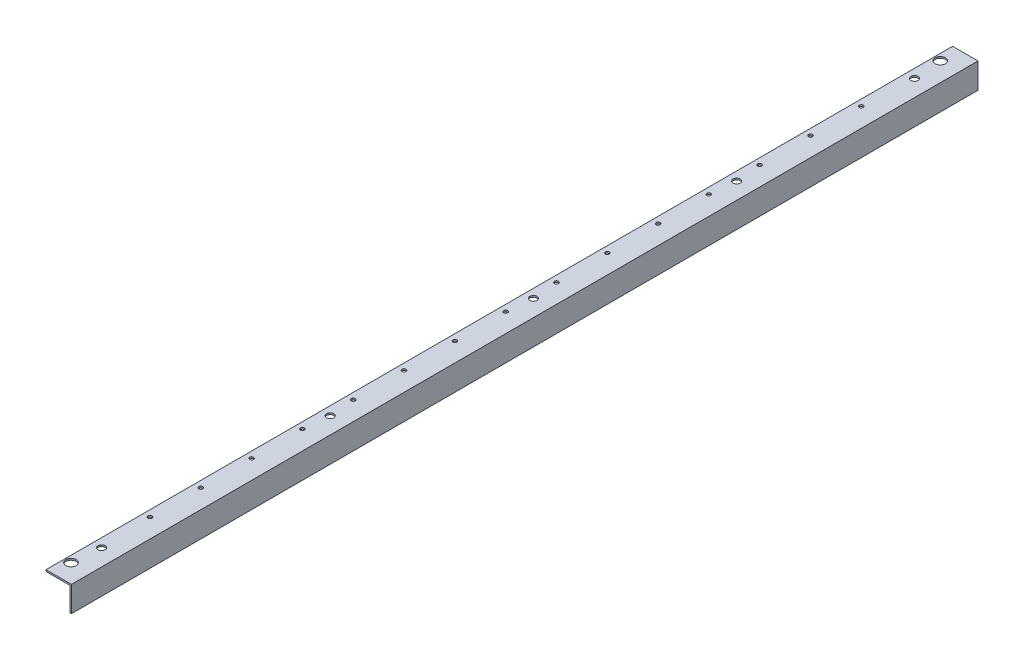
ISO-10303-21;
HEADER;
FILE_DESCRIPTION(('STEP AP214'),'2;1');
FILE_NAME('part.step','',(''),(''),'','','');
FILE_SCHEMA(('AUTOMOTIVE_DESIGN { 1 0 10303 214 1 1 1 1 }'));
ENDSEC;
DATA;
#1=APPLICATION_CONTEXT('core data for automotive mechanical design processes');
#2=APPLICATION_PROTOCOL_DEFINITION('international standard','automotive_design',2000,#1);
#3=PRODUCT_CONTEXT('',#1,'mechanical');
#4=PRODUCT('Part','Part','',(#3));
#5=PRODUCT_RELATED_PRODUCT_CATEGORY('part','',(#4));
#6=PRODUCT_DEFINITION_FORMATION('','',#4);
#7=PRODUCT_DEFINITION_CONTEXT('part definition',#1,'design');
#8=PRODUCT_DEFINITION('design','',#6,#7);
#9=PRODUCT_DEFINITION_SHAPE('','',#8);
#10=(LENGTH_UNIT() NAMED_UNIT(*) SI_UNIT(.MILLI.,.METRE.));
#11=(NAMED_UNIT(*) PLANE_ANGLE_UNIT() SI_UNIT($,.RADIAN.));
#12=(NAMED_UNIT(*) SI_UNIT($,.STERADIAN.) SOLID_ANGLE_UNIT());
#13=UNCERTAINTY_MEASURE_WITH_UNIT(LENGTH_MEASURE(1.E-05),#10,'distance_accuracy_value','');
#14=(GEOMETRIC_REPRESENTATION_CONTEXT(3) GLOBAL_UNCERTAINTY_ASSIGNED_CONTEXT((#13)) GLOBAL_UNIT_ASSIGNED_CONTEXT((#10,
#11,#12)) REPRESENTATION_CONTEXT('',''));
#15=CARTESIAN_POINT('',(0.,0.,0.));
#16=DIRECTION('',(0.,0.,1.));
#17=DIRECTION('',(1.,0.,0.));
#18=AXIS2_PLACEMENT_3D('',#15,#16,#17);
#19=CARTESIAN_POINT('',(-38.1,-44.45,1617.6625));
#20=DIRECTION('',(0.,1.,0.));
#21=DIRECTION('',(0.,0.,1.));
#22=AXIS2_PLACEMENT_3D('',#19,#20,#21);
#23=CYLINDRICAL_SURFACE('',#22,3.96874999999999);
#24=CARTESIAN_POINT('',(-38.1,0.,1617.6625));
#25=DIRECTION('',(0.,1.,0.));
#26=DIRECTION('',(0.,0.,1.));
#27=AXIS2_PLACEMENT_3D('',#24,#25,#26);
#28=CIRCLE('',#27,3.96874999999999);
#29=CARTESIAN_POINT('',(-38.1,0.,1621.63125));
#30=VERTEX_POINT('',#29);
#31=EDGE_CURVE('E42',#30,#30,#28,.T.);
#32=ORIENTED_EDGE('',*,*,#31,.T.);
#33=EDGE_LOOP('',(#32));
#34=FACE_BOUND('',#33,.T.);
#35=CARTESIAN_POINT('',(-38.1,-3.175,1617.6625));
#36=DIRECTION('',(0.,1.,0.));
#37=DIRECTION('',(0.,0.,1.));
#38=AXIS2_PLACEMENT_3D('',#35,#36,#37);
#39=CIRCLE('',#38,3.96874999999999);
#40=CARTESIAN_POINT('',(-38.1,-3.175,1621.63125));
#41=VERTEX_POINT('',#40);
#42=EDGE_CURVE('E11',#41,#41,#39,.T.);
#43=ORIENTED_EDGE('',*,*,#42,.F.);
#44=EDGE_LOOP('',(#43));
#45=FACE_BOUND('',#44,.T.);
#46=ADVANCED_FACE('F34',(#34,#45),#23,.F.);
#47=CARTESIAN_POINT('',(-38.1,-44.45,1516.0625));
#48=DIRECTION('',(0.,1.,0.));
#49=DIRECTION('',(0.,0.,1.));
#50=AXIS2_PLACEMENT_3D('',#47,#48,#49);
#51=CYLINDRICAL_SURFACE('',#50,3.96874999999999);
#52=CARTESIAN_POINT('',(-38.1,0.,1516.0625));
#53=DIRECTION('',(0.,1.,0.));
#54=DIRECTION('',(0.,0.,1.));
#55=AXIS2_PLACEMENT_3D('',#52,#53,#54);
#56=CIRCLE('',#55,3.96874999999999);
#57=CARTESIAN_POINT('',(-38.1,0.,1520.03125));
#58=VERTEX_POINT('',#57);
#59=EDGE_CURVE('E232',#58,#58,#56,.T.);
#60=ORIENTED_EDGE('',*,*,#59,.T.);
#61=EDGE_LOOP('',(#60));
#62=FACE_BOUND('',#61,.T.);
#63=CARTESIAN_POINT('',(-38.1,-3.175,1516.0625));
#64=DIRECTION('',(0.,1.,0.));
#65=DIRECTION('',(0.,0.,1.));
#66=AXIS2_PLACEMENT_3D('',#63,#64,#65);
#67=CIRCLE('',#66,3.96874999999999);
#68=CARTESIAN_POINT('',(-38.1,-3.175,1520.03125));
#69=VERTEX_POINT('',#68);
#70=EDGE_CURVE('E235',#69,#69,#67,.T.);
#71=ORIENTED_EDGE('',*,*,#70,.F.);
#72=EDGE_LOOP('',(#71));
#73=FACE_BOUND('',#72,.T.);
#74=ADVANCED_FACE('F260',(#62,#73),#51,.F.);
#75=CARTESIAN_POINT('',(-38.1,-44.45,1414.4625));
#76=DIRECTION('',(0.,1.,0.));
#77=DIRECTION('',(0.,0.,1.));
#78=AXIS2_PLACEMENT_3D('',#75,#76,#77);
#79=CYLINDRICAL_SURFACE('',#78,3.96874999999999);
#80=CARTESIAN_POINT('',(-38.1,0.,1414.4625));
#81=DIRECTION('',(0.,1.,0.));
#82=DIRECTION('',(0.,0.,1.));
#83=AXIS2_PLACEMENT_3D('',#80,#81,#82);
#84=CIRCLE('',#83,3.96874999999999);
#85=CARTESIAN_POINT('',(-38.1,0.,1418.43125));
#86=VERTEX_POINT('',#85);
#87=EDGE_CURVE('E226',#86,#86,#84,.T.);
#88=ORIENTED_EDGE('',*,*,#87,.T.);
#89=EDGE_LOOP('',(#88));
#90=FACE_BOUND('',#89,.T.);
#91=CARTESIAN_POINT('',(-38.1,-3.175,1414.4625));
#92=DIRECTION('',(0.,1.,0.));
#93=DIRECTION('',(0.,0.,1.));
#94=AXIS2_PLACEMENT_3D('',#91,#92,#93);
#95=CIRCLE('',#94,3.96874999999999);
#96=CARTESIAN_POINT('',(-38.1,-3.175,1418.43125));
#97=VERTEX_POINT('',#96);
#98=EDGE_CURVE('E229',#97,#97,#95,.T.);
#99=ORIENTED_EDGE('',*,*,#98,.F.);
#100=EDGE_LOOP('',(#99));
#101=FACE_BOUND('',#100,.T.);
#102=ADVANCED_FACE('F264',(#90,#101),#79,.F.);
#103=CARTESIAN_POINT('',(-38.1,-44.45,1312.8625));
#104=DIRECTION('',(0.,1.,0.));
#105=DIRECTION('',(0.,0.,1.));
#106=AXIS2_PLACEMENT_3D('',#103,#104,#105);
#107=CYLINDRICAL_SURFACE('',#106,3.96874999999999);
#108=CARTESIAN_POINT('',(-38.1,0.,1312.8625));
#109=DIRECTION('',(0.,1.,0.));
#110=DIRECTION('',(0.,0.,1.));
#111=AXIS2_PLACEMENT_3D('',#108,#109,#110);
#112=CIRCLE('',#111,3.96874999999999);
#113=CARTESIAN_POINT('',(-38.1,0.,1316.83125));
#114=VERTEX_POINT('',#113);
#115=EDGE_CURVE('E220',#114,#114,#112,.T.);
#116=ORIENTED_EDGE('',*,*,#115,.T.);
#117=EDGE_LOOP('',(#116));
#118=FACE_BOUND('',#117,.T.);
#119=CARTESIAN_POINT('',(-38.1,-3.175,1312.8625));
#120=DIRECTION('',(0.,1.,0.));
#121=DIRECTION('',(0.,0.,1.));
#122=AXIS2_PLACEMENT_3D('',#119,#120,#121);
#123=CIRCLE('',#122,3.96874999999999);
#124=CARTESIAN_POINT('',(-38.1,-3.175,1316.83125));
#125=VERTEX_POINT('',#124);
#126=EDGE_CURVE('E223',#125,#125,#123,.T.);
#127=ORIENTED_EDGE('',*,*,#126,.F.);
#128=EDGE_LOOP('',(#127));
#129=FACE_BOUND('',#128,.T.);
#130=ADVANCED_FACE('F269',(#118,#129),#107,.F.);
#131=CARTESIAN_POINT('',(-38.1,-44.45,1211.2625));
#132=DIRECTION('',(0.,1.,0.));
#133=DIRECTION('',(0.,0.,1.));
#134=AXIS2_PLACEMENT_3D('',#131,#132,#133);
#135=CYLINDRICAL_SURFACE('',#134,3.96874999999999);
#136=CARTESIAN_POINT('',(-38.1,0.,1211.2625));
#137=DIRECTION('',(0.,1.,0.));
#138=DIRECTION('',(0.,0.,1.));
#139=AXIS2_PLACEMENT_3D('',#136,#137,#138);
#140=CIRCLE('',#139,3.96874999999999);
#141=CARTESIAN_POINT('',(-38.1,0.,1215.23125));
#142=VERTEX_POINT('',#141);
#143=EDGE_CURVE('E214',#142,#142,#140,.T.);
#144=ORIENTED_EDGE('',*,*,#143,.T.);
#145=EDGE_LOOP('',(#144));
#146=FACE_BOUND('',#145,.T.);
#147=CARTESIAN_POINT('',(-38.1,-3.175,1211.2625));
#148=DIRECTION('',(0.,1.,0.));
#149=DIRECTION('',(0.,0.,1.));
#150=AXIS2_PLACEMENT_3D('',#147,#148,#149);
#151=CIRCLE('',#150,3.96874999999999);
#152=CARTESIAN_POINT('',(-38.1,-3.175,1215.23125));
#153=VERTEX_POINT('',#152);
#154=EDGE_CURVE('E217',#153,#153,#151,.T.);
#155=ORIENTED_EDGE('',*,*,#154,.F.);
#156=EDGE_LOOP('',(#155));
#157=FACE_BOUND('',#156,.T.);
#158=ADVANCED_FACE('F276',(#146,#157),#135,.F.);
#159=CARTESIAN_POINT('',(-38.1,-44.45,1109.6625));
#160=DIRECTION('',(0.,1.,0.));
#161=DIRECTION('',(0.,0.,1.));
#162=AXIS2_PLACEMENT_3D('',#159,#160,#161);
#163=CYLINDRICAL_SURFACE('',#162,3.96874999999999);
#164=CARTESIAN_POINT('',(-38.1,0.,1109.6625));
#165=DIRECTION('',(0.,1.,0.));
#166=DIRECTION('',(0.,0.,1.));
#167=AXIS2_PLACEMENT_3D('',#164,#165,#166);
#168=CIRCLE('',#167,3.96874999999999);
#169=CARTESIAN_POINT('',(-38.1,0.,1113.63125));
#170=VERTEX_POINT('',#169);
#171=EDGE_CURVE('E208',#170,#170,#168,.T.);
#172=ORIENTED_EDGE('',*,*,#171,.T.);
#173=EDGE_LOOP('',(#172));
#174=FACE_BOUND('',#173,.T.);
#175=CARTESIAN_POINT('',(-38.1,-3.175,1109.6625));
#176=DIRECTION('',(0.,1.,0.));
#177=DIRECTION('',(0.,0.,1.));
#178=AXIS2_PLACEMENT_3D('',#175,#176,#177);
#179=CIRCLE('',#178,3.96874999999999);
#180=CARTESIAN_POINT('',(-38.1,-3.175,1113.63125));
#181=VERTEX_POINT('',#180);
#182=EDGE_CURVE('E211',#181,#181,#179,.T.);
#183=ORIENTED_EDGE('',*,*,#182,.F.);
#184=EDGE_LOOP('',(#183));
#185=FACE_BOUND('',#184,.T.);
#186=ADVANCED_FACE('F280',(#174,#185),#163,.F.);
#187=CARTESIAN_POINT('',(-38.1,-44.45,1008.0625));
#188=DIRECTION('',(0.,1.,0.));
#189=DIRECTION('',(0.,0.,1.));
#190=AXIS2_PLACEMENT_3D('',#187,#188,#189);
#191=CYLINDRICAL_SURFACE('',#190,3.96874999999999);
#192=CARTESIAN_POINT('',(-38.1,0.,1008.0625));
#193=DIRECTION('',(0.,1.,0.));
#194=DIRECTION('',(0.,0.,1.));
#195=AXIS2_PLACEMENT_3D('',#192,#193,#194);
#196=CIRCLE('',#195,3.96874999999999);
#197=CARTESIAN_POINT('',(-38.1,0.,1012.03125));
#198=VERTEX_POINT('',#197);
#199=EDGE_CURVE('E202',#198,#198,#196,.T.);
#200=ORIENTED_EDGE('',*,*,#199,.T.);
#201=EDGE_LOOP('',(#200));
#202=FACE_BOUND('',#201,.T.);
#203=CARTESIAN_POINT('',(-38.1,-3.175,1008.0625));
#204=DIRECTION('',(0.,1.,0.));
#205=DIRECTION('',(0.,0.,1.));
#206=AXIS2_PLACEMENT_3D('',#203,#204,#205);
#207=CIRCLE('',#206,3.96874999999999);
#208=CARTESIAN_POINT('',(-38.1,-3.175,1012.03125));
#209=VERTEX_POINT('',#208);
#210=EDGE_CURVE('E205',#209,#209,#207,.T.);
#211=ORIENTED_EDGE('',*,*,#210,.F.);
#212=EDGE_LOOP('',(#211));
#213=FACE_BOUND('',#212,.T.);
#214=ADVANCED_FACE('F284',(#202,#213),#191,.F.);
#215=CARTESIAN_POINT('',(-38.1,-44.45,906.4625));
#216=DIRECTION('',(0.,1.,0.));
#217=DIRECTION('',(0.,0.,1.));
#218=AXIS2_PLACEMENT_3D('',#215,#216,#217);
#219=CYLINDRICAL_SURFACE('',#218,3.96874999999999);
#220=CARTESIAN_POINT('',(-38.1,0.,906.4625));
#221=DIRECTION('',(0.,1.,0.));
#222=DIRECTION('',(0.,0.,1.));
#223=AXIS2_PLACEMENT_3D('',#220,#221,#222);
#224=CIRCLE('',#223,3.96874999999999);
#225=CARTESIAN_POINT('',(-38.1,0.,910.43125));
#226=VERTEX_POINT('',#225);
#227=EDGE_CURVE('E196',#226,#226,#224,.T.);
#228=ORIENTED_EDGE('',*,*,#227,.T.);
#229=EDGE_LOOP('',(#228));
#230=FACE_BOUND('',#229,.T.);
#231=CARTESIAN_POINT('',(-38.1,-3.175,906.4625));
#232=DIRECTION('',(0.,1.,0.));
#233=DIRECTION('',(0.,0.,1.));
#234=AXIS2_PLACEMENT_3D('',#231,#232,#233);
#235=CIRCLE('',#234,3.96874999999999);
#236=CARTESIAN_POINT('',(-38.1,-3.175,910.43125));
#237=VERTEX_POINT('',#236);
#238=EDGE_CURVE('E199',#237,#237,#235,.T.);
#239=ORIENTED_EDGE('',*,*,#238,.F.);
#240=EDGE_LOOP('',(#239));
#241=FACE_BOUND('',#240,.T.);
#242=ADVANCED_FACE('F288',(#230,#241),#219,.F.);
#243=CARTESIAN_POINT('',(-38.1,-44.45,804.8625));
#244=DIRECTION('',(0.,1.,0.));
#245=DIRECTION('',(0.,0.,1.));
#246=AXIS2_PLACEMENT_3D('',#243,#244,#245);
#247=CYLINDRICAL_SURFACE('',#246,3.96874999999999);
#248=CARTESIAN_POINT('',(-38.1,0.,804.8625));
#249=DIRECTION('',(0.,1.,0.));
#250=DIRECTION('',(0.,0.,1.));
#251=AXIS2_PLACEMENT_3D('',#248,#249,#250);
#252=CIRCLE('',#251,3.96874999999999);
#253=CARTESIAN_POINT('',(-38.1,0.,808.83125));
#254=VERTEX_POINT('',#253);
#255=EDGE_CURVE('E190',#254,#254,#252,.T.);
#256=ORIENTED_EDGE('',*,*,#255,.T.);
#257=EDGE_LOOP('',(#256));
#258=FACE_BOUND('',#257,.T.);
#259=CARTESIAN_POINT('',(-38.1,-3.175,804.8625));
#260=DIRECTION('',(0.,1.,0.));
#261=DIRECTION('',(0.,0.,1.));
#262=AXIS2_PLACEMENT_3D('',#259,#260,#261);
#263=CIRCLE('',#262,3.96874999999999);
#264=CARTESIAN_POINT('',(-38.1,-3.175,808.83125));
#265=VERTEX_POINT('',#264);
#266=EDGE_CURVE('E193',#265,#265,#263,.T.);
#267=ORIENTED_EDGE('',*,*,#266,.F.);
#268=EDGE_LOOP('',(#267));
#269=FACE_BOUND('',#268,.T.);
#270=ADVANCED_FACE('F292',(#258,#269),#247,.F.);
#271=CARTESIAN_POINT('',(-38.1,-44.45,703.2625));
#272=DIRECTION('',(0.,1.,0.));
#273=DIRECTION('',(0.,0.,1.));
#274=AXIS2_PLACEMENT_3D('',#271,#272,#273);
#275=CYLINDRICAL_SURFACE('',#274,3.96874999999999);
#276=CARTESIAN_POINT('',(-38.1,0.,703.2625));
#277=DIRECTION('',(0.,1.,0.));
#278=DIRECTION('',(0.,0.,1.));
#279=AXIS2_PLACEMENT_3D('',#276,#277,#278);
#280=CIRCLE('',#279,3.96874999999999);
#281=CARTESIAN_POINT('',(-38.1,0.,707.23125));
#282=VERTEX_POINT('',#281);
#283=EDGE_CURVE('E184',#282,#282,#280,.T.);
#284=ORIENTED_EDGE('',*,*,#283,.T.);
#285=EDGE_LOOP('',(#284));
#286=FACE_BOUND('',#285,.T.);
#287=CARTESIAN_POINT('',(-38.1,-3.175,703.2625));
#288=DIRECTION('',(0.,1.,0.));
#289=DIRECTION('',(0.,0.,1.));
#290=AXIS2_PLACEMENT_3D('',#287,#288,#289);
#291=CIRCLE('',#290,3.96874999999999);
#292=CARTESIAN_POINT('',(-38.1,-3.175,707.23125));
#293=VERTEX_POINT('',#292);
#294=EDGE_CURVE('E187',#293,#293,#291,.T.);
#295=ORIENTED_EDGE('',*,*,#294,.F.);
#296=EDGE_LOOP('',(#295));
#297=FACE_BOUND('',#296,.T.);
#298=ADVANCED_FACE('F296',(#286,#297),#275,.F.);
#299=CARTESIAN_POINT('',(-38.1,-44.45,601.6625));
#300=DIRECTION('',(0.,1.,0.));
#301=DIRECTION('',(0.,0.,1.));
#302=AXIS2_PLACEMENT_3D('',#299,#300,#301);
#303=CYLINDRICAL_SURFACE('',#302,3.96874999999999);
#304=CARTESIAN_POINT('',(-38.1,0.,601.6625));
#305=DIRECTION('',(0.,1.,0.));
#306=DIRECTION('',(0.,0.,1.));
#307=AXIS2_PLACEMENT_3D('',#304,#305,#306);
#308=CIRCLE('',#307,3.96874999999999);
#309=CARTESIAN_POINT('',(-38.1,0.,605.63125));
#310=VERTEX_POINT('',#309);
#311=EDGE_CURVE('E178',#310,#310,#308,.T.);
#312=ORIENTED_EDGE('',*,*,#311,.T.);
#313=EDGE_LOOP('',(#312));
#314=FACE_BOUND('',#313,.T.);
#315=CARTESIAN_POINT('',(-38.1,-3.175,601.6625));
#316=DIRECTION('',(0.,1.,0.));
#317=DIRECTION('',(0.,0.,1.));
#318=AXIS2_PLACEMENT_3D('',#315,#316,#317);
#319=CIRCLE('',#318,3.96874999999999);
#320=CARTESIAN_POINT('',(-38.1,-3.175,605.63125));
#321=VERTEX_POINT('',#320);
#322=EDGE_CURVE('E181',#321,#321,#319,.T.);
#323=ORIENTED_EDGE('',*,*,#322,.F.);
#324=EDGE_LOOP('',(#323));
#325=FACE_BOUND('',#324,.T.);
#326=ADVANCED_FACE('F300',(#314,#325),#303,.F.);
#327=CARTESIAN_POINT('',(-38.1,-44.45,500.0625));
#328=DIRECTION('',(0.,1.,0.));
#329=DIRECTION('',(0.,0.,1.));
#330=AXIS2_PLACEMENT_3D('',#327,#328,#329);
#331=CYLINDRICAL_SURFACE('',#330,3.96874999999999);
#332=CARTESIAN_POINT('',(-38.1,0.,500.0625));
#333=DIRECTION('',(0.,1.,0.));
#334=DIRECTION('',(0.,0.,1.));
#335=AXIS2_PLACEMENT_3D('',#332,#333,#334);
#336=CIRCLE('',#335,3.96874999999999);
#337=CARTESIAN_POINT('',(-38.1,0.,504.03125));
#338=VERTEX_POINT('',#337);
#339=EDGE_CURVE('E172',#338,#338,#336,.T.);
#340=ORIENTED_EDGE('',*,*,#339,.T.);
#341=EDGE_LOOP('',(#340));
#342=FACE_BOUND('',#341,.T.);
#343=CARTESIAN_POINT('',(-38.1,-3.175,500.0625));
#344=DIRECTION('',(0.,1.,0.));
#345=DIRECTION('',(0.,0.,1.));
#346=AXIS2_PLACEMENT_3D('',#343,#344,#345);
#347=CIRCLE('',#346,3.96874999999999);
#348=CARTESIAN_POINT('',(-38.1,-3.175,504.03125));
#349=VERTEX_POINT('',#348);
#350=EDGE_CURVE('E175',#349,#349,#347,.T.);
#351=ORIENTED_EDGE('',*,*,#350,.F.);
#352=EDGE_LOOP('',(#351));
#353=FACE_BOUND('',#352,.T.);
#354=ADVANCED_FACE('F304',(#342,#353),#331,.F.);
#355=CARTESIAN_POINT('',(-38.1,-44.45,398.4625));
#356=DIRECTION('',(0.,1.,0.));
#357=DIRECTION('',(0.,0.,1.));
#358=AXIS2_PLACEMENT_3D('',#355,#356,#357);
#359=CYLINDRICAL_SURFACE('',#358,3.96874999999999);
#360=CARTESIAN_POINT('',(-38.1,0.,398.4625));
#361=DIRECTION('',(0.,1.,0.));
#362=DIRECTION('',(0.,0.,1.));
#363=AXIS2_PLACEMENT_3D('',#360,#361,#362);
#364=CIRCLE('',#363,3.96874999999999);
#365=CARTESIAN_POINT('',(-38.1,0.,402.43125));
#366=VERTEX_POINT('',#365);
#367=EDGE_CURVE('E140',#366,#366,#364,.T.);
#368=ORIENTED_EDGE('',*,*,#367,.T.);
#369=EDGE_LOOP('',(#368));
#370=FACE_BOUND('',#369,.T.);
#371=CARTESIAN_POINT('',(-38.1,-3.175,398.4625));
#372=DIRECTION('',(0.,1.,0.));
#373=DIRECTION('',(0.,0.,1.));
#374=AXIS2_PLACEMENT_3D('',#371,#372,#373);
#375=CIRCLE('',#374,3.96874999999999);
#376=CARTESIAN_POINT('',(-38.1,-3.175,402.43125));
#377=VERTEX_POINT('',#376);
#378=EDGE_CURVE('E169',#377,#377,#375,.T.);
#379=ORIENTED_EDGE('',*,*,#378,.F.);
#380=EDGE_LOOP('',(#379));
#381=FACE_BOUND('',#380,.T.);
#382=ADVANCED_FACE('F254',(#370,#381),#359,.F.);
#383=CARTESIAN_POINT('',(0.,-50.8,1812.925));
#384=DIRECTION('',(-1.,0.,0.));
#385=DIRECTION('',(0.,0.,1.));
#386=AXIS2_PLACEMENT_3D('',#383,#384,#385);
#387=PLANE('',#386);
#388=DIRECTION('',(0.,1.,0.));
#389=VECTOR('',#388,1.);
#390=CARTESIAN_POINT('',(0.,-50.8,0.));
#391=LINE('',#390,#389);
#392=CARTESIAN_POINT('',(0.,-50.8,0.));
#393=VERTEX_POINT('',#392);
#394=CARTESIAN_POINT('',(0.,0.,0.));
#395=VERTEX_POINT('',#394);
#396=EDGE_CURVE('E120',#393,#395,#391,.T.);
#397=ORIENTED_EDGE('',*,*,#396,.T.);
#398=DIRECTION('',(0.,0.,-1.));
#399=VECTOR('',#398,1.);
#400=CARTESIAN_POINT('',(0.,0.,1812.925));
#401=LINE('',#400,#399);
#402=CARTESIAN_POINT('',(0.,0.,1812.925));
#403=VERTEX_POINT('',#402);
#404=EDGE_CURVE('E138',#403,#395,#401,.T.);
#405=ORIENTED_EDGE('',*,*,#404,.F.);
#406=DIRECTION('',(0.,1.,0.));
#407=VECTOR('',#406,1.);
#408=CARTESIAN_POINT('',(0.,-50.8,1812.925));
#409=LINE('',#408,#407);
#410=CARTESIAN_POINT('',(0.,-50.8,1812.925));
#411=VERTEX_POINT('',#410);
#412=EDGE_CURVE('E131',#411,#403,#409,.T.);
#413=ORIENTED_EDGE('',*,*,#412,.F.);
#414=DIRECTION('',(0.,0.,-1.));
#415=VECTOR('',#414,1.);
#416=CARTESIAN_POINT('',(0.,-50.8,1812.925));
#417=LINE('',#416,#415);
#418=EDGE_CURVE('E116',#411,#393,#417,.T.);
#419=ORIENTED_EDGE('',*,*,#418,.T.);
#420=EDGE_LOOP('',(#397,#405,#413,#419));
#421=FACE_BOUND('',#420,.T.);
#422=ADVANCED_FACE('F245',(#421),#387,.F.);
#423=CARTESIAN_POINT('',(0.,0.,1812.925));
#424=DIRECTION('',(0.,-1.,0.));
#425=DIRECTION('',(0.,0.,-1.));
#426=AXIS2_PLACEMENT_3D('',#423,#424,#425);
#427=PLANE('',#426);
#428=CARTESIAN_POINT('',(-38.1,0.,296.8625));
#429=DIRECTION('',(0.,1.,0.));
#430=DIRECTION('',(0.,0.,1.));
#431=AXIS2_PLACEMENT_3D('',#428,#429,#430);
#432=CIRCLE('',#431,3.96874999999999);
#433=CARTESIAN_POINT('',(-38.1,0.,300.83125));
#434=VERTEX_POINT('',#433);
#435=EDGE_CURVE('E408',#434,#434,#432,.T.);
#436=ORIENTED_EDGE('',*,*,#435,.F.);
#437=EDGE_LOOP('',(#436));
#438=FACE_BOUND('',#437,.T.);
#439=CARTESIAN_POINT('',(-38.1,0.,195.2625));
#440=DIRECTION('',(0.,1.,0.));
#441=DIRECTION('',(0.,0.,1.));
#442=AXIS2_PLACEMENT_3D('',#439,#440,#441);
#443=CIRCLE('',#442,3.96874999999999);
#444=CARTESIAN_POINT('',(-38.1,0.,199.23125));
#445=VERTEX_POINT('',#444);
#446=EDGE_CURVE('E166',#445,#445,#443,.T.);
#447=ORIENTED_EDGE('',*,*,#446,.F.);
#448=EDGE_LOOP('',(#447));
#449=FACE_BOUND('',#448,.T.);
#450=CARTESIAN_POINT('',(-38.1,0.,37.3062500000001));
#451=DIRECTION('',(0.,1.,0.));
#452=DIRECTION('',(0.,0.,1.));
#453=AXIS2_PLACEMENT_3D('',#450,#451,#452);
#454=CIRCLE('',#453,10.31875);
#455=CARTESIAN_POINT('',(-38.1,0.,47.6250000000001));
#456=VERTEX_POINT('',#455);
#457=EDGE_CURVE('E145',#456,#456,#454,.T.);
#458=ORIENTED_EDGE('',*,*,#457,.F.);
#459=EDGE_LOOP('',(#458));
#460=FACE_BOUND('',#459,.T.);
#461=CARTESIAN_POINT('',(-33.3375,0.,1719.2625));
#462=DIRECTION('',(0.,1.,0.));
#463=DIRECTION('',(0.,0.,1.));
#464=AXIS2_PLACEMENT_3D('',#461,#462,#463);
#465=CIRCLE('',#464,7.14375000000008);
#466=CARTESIAN_POINT('',(-33.3375,0.,1726.40625));
#467=VERTEX_POINT('',#466);
#468=EDGE_CURVE('E165',#467,#467,#465,.T.);
#469=ORIENTED_EDGE('',*,*,#468,.F.);
#470=EDGE_LOOP('',(#469));
#471=FACE_BOUND('',#470,.T.);
#472=CARTESIAN_POINT('',(-33.3375,0.,1262.0625));
#473=DIRECTION('',(0.,1.,0.));
#474=DIRECTION('',(0.,0.,1.));
#475=AXIS2_PLACEMENT_3D('',#472,#473,#474);
#476=CIRCLE('',#475,7.14375);
#477=CARTESIAN_POINT('',(-33.3375,0.,1269.20625));
#478=VERTEX_POINT('',#477);
#479=EDGE_CURVE('E419',#478,#478,#476,.T.);
#480=ORIENTED_EDGE('',*,*,#479,.F.);
#481=EDGE_LOOP('',(#480));
#482=FACE_BOUND('',#481,.T.);
#483=CARTESIAN_POINT('',(-38.0999999999999,0.,1775.61875));
#484=DIRECTION('',(0.,1.,0.));
#485=DIRECTION('',(0.,0.,1.));
#486=AXIS2_PLACEMENT_3D('',#483,#484,#485);
#487=CIRCLE('',#486,10.31875);
#488=CARTESIAN_POINT('',(-38.0999999999999,0.,1785.9375));
#489=VERTEX_POINT('',#488);
#490=EDGE_CURVE('E418',#489,#489,#487,.T.);
#491=ORIENTED_EDGE('',*,*,#490,.F.);
#492=EDGE_LOOP('',(#491));
#493=FACE_BOUND('',#492,.T.);
#494=CARTESIAN_POINT('',(-33.3375,0.,93.6625));
#495=DIRECTION('',(0.,1.,0.));
#496=DIRECTION('',(0.,0.,1.));
#497=AXIS2_PLACEMENT_3D('',#494,#495,#496);
#498=CIRCLE('',#497,7.14375);
#499=CARTESIAN_POINT('',(-33.3375,0.,100.80625));
#500=VERTEX_POINT('',#499);
#501=EDGE_CURVE('E428',#500,#500,#498,.T.);
#502=ORIENTED_EDGE('',*,*,#501,.F.);
#503=EDGE_LOOP('',(#502));
#504=FACE_BOUND('',#503,.T.);
#505=CARTESIAN_POINT('',(-33.3375,0.,449.2625));
#506=DIRECTION('',(0.,1.,0.));
#507=DIRECTION('',(0.,0.,1.));
#508=AXIS2_PLACEMENT_3D('',#505,#506,#507);
#509=CIRCLE('',#508,7.14375000000002);
#510=CARTESIAN_POINT('',(-33.3375,0.,456.40625));
#511=VERTEX_POINT('',#510);
#512=EDGE_CURVE('E425',#511,#511,#509,.T.);
#513=ORIENTED_EDGE('',*,*,#512,.F.);
#514=EDGE_LOOP('',(#513));
#515=FACE_BOUND('',#514,.T.);
#516=CARTESIAN_POINT('',(-33.3375,0.,855.6625));
#517=DIRECTION('',(0.,1.,0.));
#518=DIRECTION('',(0.,0.,1.));
#519=AXIS2_PLACEMENT_3D('',#516,#517,#518);
#520=CIRCLE('',#519,7.14374999999997);
#521=CARTESIAN_POINT('',(-33.3375,0.,862.80625));
#522=VERTEX_POINT('',#521);
#523=EDGE_CURVE('E422',#522,#522,#520,.T.);
#524=ORIENTED_EDGE('',*,*,#523,.F.);
#525=EDGE_LOOP('',(#524));
#526=FACE_BOUND('',#525,.T.);
#527=DIRECTION('',(-1.,0.,0.));
#528=VECTOR('',#527,1.);
#529=CARTESIAN_POINT('',(0.,0.,0.));
#530=LINE('',#529,#528);
#531=CARTESIAN_POINT('',(-50.8,0.,0.));
#532=VERTEX_POINT('',#531);
#533=EDGE_CURVE('E123',#395,#532,#530,.T.);
#534=ORIENTED_EDGE('',*,*,#533,.T.);
#535=DIRECTION('',(0.,0.,-1.));
#536=VECTOR('',#535,1.);
#537=CARTESIAN_POINT('',(-50.8,0.,1812.925));
#538=LINE('',#537,#536);
#539=CARTESIAN_POINT('',(-50.8,0.,1812.925));
#540=VERTEX_POINT('',#539);
#541=EDGE_CURVE('E135',#540,#532,#538,.T.);
#542=ORIENTED_EDGE('',*,*,#541,.F.);
#543=DIRECTION('',(-1.,0.,0.));
#544=VECTOR('',#543,1.);
#545=CARTESIAN_POINT('',(0.,0.,1812.925));
#546=LINE('',#545,#544);
#547=EDGE_CURVE('E88',#403,#540,#546,.T.);
#548=ORIENTED_EDGE('',*,*,#547,.F.);
#549=ORIENTED_EDGE('',*,*,#404,.T.);
#550=EDGE_LOOP('',(#534,#542,#548,#549));
#551=FACE_BOUND('',#550,.T.);
#552=ORIENTED_EDGE('',*,*,#367,.F.);
#553=EDGE_LOOP('',(#552));
#554=FACE_BOUND('',#553,.T.);
#555=ORIENTED_EDGE('',*,*,#339,.F.);
#556=EDGE_LOOP('',(#555));
#557=FACE_BOUND('',#556,.T.);
#558=ORIENTED_EDGE('',*,*,#311,.F.);
#559=EDGE_LOOP('',(#558));
#560=FACE_BOUND('',#559,.T.);
#561=ORIENTED_EDGE('',*,*,#283,.F.);
#562=EDGE_LOOP('',(#561));
#563=FACE_BOUND('',#562,.T.);
#564=ORIENTED_EDGE('',*,*,#255,.F.);
#565=EDGE_LOOP('',(#564));
#566=FACE_BOUND('',#565,.T.);
#567=ORIENTED_EDGE('',*,*,#227,.F.);
#568=EDGE_LOOP('',(#567));
#569=FACE_BOUND('',#568,.T.);
#570=ORIENTED_EDGE('',*,*,#199,.F.);
#571=EDGE_LOOP('',(#570));
#572=FACE_BOUND('',#571,.T.);
#573=ORIENTED_EDGE('',*,*,#171,.F.);
#574=EDGE_LOOP('',(#573));
#575=FACE_BOUND('',#574,.T.);
#576=ORIENTED_EDGE('',*,*,#143,.F.);
#577=EDGE_LOOP('',(#576));
#578=FACE_BOUND('',#577,.T.);
#579=ORIENTED_EDGE('',*,*,#115,.F.);
#580=EDGE_LOOP('',(#579));
#581=FACE_BOUND('',#580,.T.);
#582=ORIENTED_EDGE('',*,*,#87,.F.);
#583=EDGE_LOOP('',(#582));
#584=FACE_BOUND('',#583,.T.);
#585=ORIENTED_EDGE('',*,*,#59,.F.);
#586=EDGE_LOOP('',(#585));
#587=FACE_BOUND('',#586,.T.);
#588=ORIENTED_EDGE('',*,*,#31,.F.);
#589=EDGE_LOOP('',(#588));
#590=FACE_BOUND('',#589,.T.);
#591=ADVANCED_FACE('F242',(#438,#449,#460,#471,#482,#493,#504,#515,#526,#551,#554,#557,#560,
#563,#566,#569,#572,#575,#578,#581,#584,#587,#590),#427,.F.);
#592=CARTESIAN_POINT('',(-50.8,0.,1812.925));
#593=DIRECTION('',(1.,0.,0.));
#594=DIRECTION('',(0.,0.,-1.));
#595=AXIS2_PLACEMENT_3D('',#592,#593,#594);
#596=PLANE('',#595);
#597=DIRECTION('',(0.,-1.,0.));
#598=VECTOR('',#597,1.);
#599=CARTESIAN_POINT('',(-50.8,0.,0.));
#600=LINE('',#599,#598);
#601=CARTESIAN_POINT('',(-50.8,-3.17500000000001,0.));
#602=VERTEX_POINT('',#601);
#603=EDGE_CURVE('E126',#532,#602,#600,.T.);
#604=ORIENTED_EDGE('',*,*,#603,.T.);
#605=DIRECTION('',(0.,0.,-1.));
#606=VECTOR('',#605,1.);
#607=CARTESIAN_POINT('',(-50.8,-3.17500000000001,1812.925));
#608=LINE('',#607,#606);
#609=CARTESIAN_POINT('',(-50.8,-3.17500000000001,1812.925));
#610=VERTEX_POINT('',#609);
#611=EDGE_CURVE('E111',#610,#602,#608,.T.);
#612=ORIENTED_EDGE('',*,*,#611,.F.);
#613=DIRECTION('',(0.,-1.,0.));
#614=VECTOR('',#613,1.);
#615=CARTESIAN_POINT('',(-50.8,0.,1812.925));
#616=LINE('',#615,#614);
#617=EDGE_CURVE('E101',#540,#610,#616,.T.);
#618=ORIENTED_EDGE('',*,*,#617,.F.);
#619=ORIENTED_EDGE('',*,*,#541,.T.);
#620=EDGE_LOOP('',(#604,#612,#618,#619));
#621=FACE_BOUND('',#620,.T.);
#622=ADVANCED_FACE('F244',(#621),#596,.F.);
#623=CARTESIAN_POINT('',(-50.8,-3.17500000000001,1812.925));
#624=DIRECTION('',(0.,1.,0.));
#625=DIRECTION('',(0.,0.,1.));
#626=AXIS2_PLACEMENT_3D('',#623,#624,#625);
#627=PLANE('',#626);
#628=CARTESIAN_POINT('',(-38.1,-3.175,296.8625));
#629=DIRECTION('',(0.,1.,0.));
#630=DIRECTION('',(0.,0.,1.));
#631=AXIS2_PLACEMENT_3D('',#628,#629,#630);
#632=CIRCLE('',#631,3.96874999999999);
#633=CARTESIAN_POINT('',(-38.1,-3.175,300.83125));
#634=VERTEX_POINT('',#633);
#635=EDGE_CURVE('E410',#634,#634,#632,.T.);
#636=ORIENTED_EDGE('',*,*,#635,.T.);
#637=EDGE_LOOP('',(#636));
#638=FACE_BOUND('',#637,.T.);
#639=CARTESIAN_POINT('',(-38.1,-3.175,195.2625));
#640=DIRECTION('',(0.,1.,0.));
#641=DIRECTION('',(0.,0.,1.));
#642=AXIS2_PLACEMENT_3D('',#639,#640,#641);
#643=CIRCLE('',#642,3.96874999999999);
#644=CARTESIAN_POINT('',(-38.1,-3.175,199.23125));
#645=VERTEX_POINT('',#644);
#646=EDGE_CURVE('E162',#645,#645,#643,.T.);
#647=ORIENTED_EDGE('',*,*,#646,.T.);
#648=EDGE_LOOP('',(#647));
#649=FACE_BOUND('',#648,.T.);
#650=CARTESIAN_POINT('',(-38.1,-3.175,37.3062500000001));
#651=DIRECTION('',(0.,1.,0.));
#652=DIRECTION('',(0.,0.,1.));
#653=AXIS2_PLACEMENT_3D('',#650,#651,#652);
#654=CIRCLE('',#653,10.31875);
#655=CARTESIAN_POINT('',(-38.1,-3.175,47.6250000000001));
#656=VERTEX_POINT('',#655);
#657=EDGE_CURVE('E124',#656,#656,#654,.T.);
#658=ORIENTED_EDGE('',*,*,#657,.T.);
#659=EDGE_LOOP('',(#658));
#660=FACE_BOUND('',#659,.T.);
#661=CARTESIAN_POINT('',(-33.3375,-3.175,1719.2625));
#662=DIRECTION('',(0.,1.,0.));
#663=DIRECTION('',(0.,0.,1.));
#664=AXIS2_PLACEMENT_3D('',#661,#662,#663);
#665=CIRCLE('',#664,7.14375000000008);
#666=CARTESIAN_POINT('',(-33.3375,-3.175,1726.40625));
#667=VERTEX_POINT('',#666);
#668=EDGE_CURVE('E157',#667,#667,#665,.T.);
#669=ORIENTED_EDGE('',*,*,#668,.T.);
#670=EDGE_LOOP('',(#669));
#671=FACE_BOUND('',#670,.T.);
#672=CARTESIAN_POINT('',(-33.3375,-3.175,1262.0625));
#673=DIRECTION('',(0.,1.,0.));
#674=DIRECTION('',(0.,0.,1.));
#675=AXIS2_PLACEMENT_3D('',#672,#673,#674);
#676=CIRCLE('',#675,7.14375);
#677=CARTESIAN_POINT('',(-33.3375,-3.175,1269.20625));
#678=VERTEX_POINT('',#677);
#679=EDGE_CURVE('E154',#678,#678,#676,.T.);
#680=ORIENTED_EDGE('',*,*,#679,.T.);
#681=EDGE_LOOP('',(#680));
#682=FACE_BOUND('',#681,.T.);
#683=CARTESIAN_POINT('',(-38.0999999999999,-3.175,1775.61875));
#684=DIRECTION('',(0.,1.,0.));
#685=DIRECTION('',(0.,0.,1.));
#686=AXIS2_PLACEMENT_3D('',#683,#684,#685);
#687=CIRCLE('',#686,10.31875);
#688=CARTESIAN_POINT('',(-38.0999999999999,-3.175,1785.9375));
#689=VERTEX_POINT('',#688);
#690=EDGE_CURVE('E151',#689,#689,#687,.T.);
#691=ORIENTED_EDGE('',*,*,#690,.T.);
#692=EDGE_LOOP('',(#691));
#693=FACE_BOUND('',#692,.T.);
#694=CARTESIAN_POINT('',(-33.3375,-3.175,93.6625));
#695=DIRECTION('',(0.,1.,0.));
#696=DIRECTION('',(0.,0.,1.));
#697=AXIS2_PLACEMENT_3D('',#694,#695,#696);
#698=CIRCLE('',#697,7.14375);
#699=CARTESIAN_POINT('',(-33.3375,-3.175,100.80625));
#700=VERTEX_POINT('',#699);
#701=EDGE_CURVE('E148',#700,#700,#698,.T.);
#702=ORIENTED_EDGE('',*,*,#701,.T.);
#703=EDGE_LOOP('',(#702));
#704=FACE_BOUND('',#703,.T.);
#705=CARTESIAN_POINT('',(-33.3375,-3.175,449.2625));
#706=DIRECTION('',(0.,1.,0.));
#707=DIRECTION('',(0.,0.,1.));
#708=AXIS2_PLACEMENT_3D('',#705,#706,#707);
#709=CIRCLE('',#708,7.14375000000002);
#710=CARTESIAN_POINT('',(-33.3375,-3.175,456.40625));
#711=VERTEX_POINT('',#710);
#712=EDGE_CURVE('E144',#711,#711,#709,.T.);
#713=ORIENTED_EDGE('',*,*,#712,.T.);
#714=EDGE_LOOP('',(#713));
#715=FACE_BOUND('',#714,.T.);
#716=CARTESIAN_POINT('',(-33.3375,-3.175,855.6625));
#717=DIRECTION('',(0.,1.,0.));
#718=DIRECTION('',(0.,0.,1.));
#719=AXIS2_PLACEMENT_3D('',#716,#717,#718);
#720=CIRCLE('',#719,7.14374999999997);
#721=CARTESIAN_POINT('',(-33.3375,-3.175,862.80625));
#722=VERTEX_POINT('',#721);
#723=EDGE_CURVE('E141',#722,#722,#720,.T.);
#724=ORIENTED_EDGE('',*,*,#723,.T.);
#725=EDGE_LOOP('',(#724));
#726=FACE_BOUND('',#725,.T.);
#727=DIRECTION('',(1.,0.,0.));
#728=VECTOR('',#727,1.);
#729=CARTESIAN_POINT('',(-50.8,-3.17500000000001,0.));
#730=LINE('',#729,#728);
#731=CARTESIAN_POINT('',(-3.17500000000001,-3.17500000000001,0.));
#732=VERTEX_POINT('',#731);
#733=EDGE_CURVE('E110',#602,#732,#730,.T.);
#734=ORIENTED_EDGE('',*,*,#733,.T.);
#735=DIRECTION('',(0.,0.,-1.));
#736=VECTOR('',#735,1.);
#737=CARTESIAN_POINT('',(-3.17500000000001,-3.17500000000001,1812.925));
#738=LINE('',#737,#736);
#739=CARTESIAN_POINT('',(-3.17500000000001,-3.17500000000001,1812.925));
#740=VERTEX_POINT('',#739);
#741=EDGE_CURVE('E106',#740,#732,#738,.T.);
#742=ORIENTED_EDGE('',*,*,#741,.F.);
#743=DIRECTION('',(1.,0.,0.));
#744=VECTOR('',#743,1.);
#745=CARTESIAN_POINT('',(-50.8,-3.17500000000001,1812.925));
#746=LINE('',#745,#744);
#747=EDGE_CURVE('E95',#610,#740,#746,.T.);
#748=ORIENTED_EDGE('',*,*,#747,.F.);
#749=ORIENTED_EDGE('',*,*,#611,.T.);
#750=EDGE_LOOP('',(#734,#742,#748,#749));
#751=FACE_BOUND('',#750,.T.);
#752=ORIENTED_EDGE('',*,*,#378,.T.);
#753=EDGE_LOOP('',(#752));
#754=FACE_BOUND('',#753,.T.);
#755=ORIENTED_EDGE('',*,*,#350,.T.);
#756=EDGE_LOOP('',(#755));
#757=FACE_BOUND('',#756,.T.);
#758=ORIENTED_EDGE('',*,*,#322,.T.);
#759=EDGE_LOOP('',(#758));
#760=FACE_BOUND('',#759,.T.);
#761=ORIENTED_EDGE('',*,*,#294,.T.);
#762=EDGE_LOOP('',(#761));
#763=FACE_BOUND('',#762,.T.);
#764=ORIENTED_EDGE('',*,*,#266,.T.);
#765=EDGE_LOOP('',(#764));
#766=FACE_BOUND('',#765,.T.);
#767=ORIENTED_EDGE('',*,*,#238,.T.);
#768=EDGE_LOOP('',(#767));
#769=FACE_BOUND('',#768,.T.);
#770=ORIENTED_EDGE('',*,*,#210,.T.);
#771=EDGE_LOOP('',(#770));
#772=FACE_BOUND('',#771,.T.);
#773=ORIENTED_EDGE('',*,*,#182,.T.);
#774=EDGE_LOOP('',(#773));
#775=FACE_BOUND('',#774,.T.);
#776=ORIENTED_EDGE('',*,*,#154,.T.);
#777=EDGE_LOOP('',(#776));
#778=FACE_BOUND('',#777,.T.);
#779=ORIENTED_EDGE('',*,*,#126,.T.);
#780=EDGE_LOOP('',(#779));
#781=FACE_BOUND('',#780,.T.);
#782=ORIENTED_EDGE('',*,*,#98,.T.);
#783=EDGE_LOOP('',(#782));
#784=FACE_BOUND('',#783,.T.);
#785=ORIENTED_EDGE('',*,*,#70,.T.);
#786=EDGE_LOOP('',(#785));
#787=FACE_BOUND('',#786,.T.);
#788=ORIENTED_EDGE('',*,*,#42,.T.);
#789=EDGE_LOOP('',(#788));
#790=FACE_BOUND('',#789,.T.);
#791=ADVANCED_FACE('F107',(#638,#649,#660,#671,#682,#693,#704,#715,#726,#751,#754,#757,#760,
#763,#766,#769,#772,#775,#778,#781,#784,#787,#790),#627,.F.);
#792=CARTESIAN_POINT('',(-3.17500000000001,-3.17500000000001,1812.925));
#793=DIRECTION('',(1.,0.,0.));
#794=DIRECTION('',(0.,1.,0.));
#795=AXIS2_PLACEMENT_3D('',#792,#793,#794);
#796=PLANE('',#795);
#797=DIRECTION('',(0.,-1.,0.));
#798=VECTOR('',#797,1.);
#799=CARTESIAN_POINT('',(-3.17500000000001,-3.17500000000001,0.));
#800=LINE('',#799,#798);
#801=CARTESIAN_POINT('',(-3.175,-50.8,0.));
#802=VERTEX_POINT('',#801);
#803=EDGE_CURVE('E73',#732,#802,#800,.T.);
#804=ORIENTED_EDGE('',*,*,#803,.T.);
#805=DIRECTION('',(0.,0.,-1.));
#806=VECTOR('',#805,1.);
#807=CARTESIAN_POINT('',(-3.175,-50.8,1812.925));
#808=LINE('',#807,#806);
#809=CARTESIAN_POINT('',(-3.175,-50.8,1812.925));
#810=VERTEX_POINT('',#809);
#811=EDGE_CURVE('E112',#810,#802,#808,.T.);
#812=ORIENTED_EDGE('',*,*,#811,.F.);
#813=DIRECTION('',(0.,-1.,0.));
#814=VECTOR('',#813,1.);
#815=CARTESIAN_POINT('',(-3.17500000000001,-3.17500000000001,1812.925));
#816=LINE('',#815,#814);
#817=EDGE_CURVE('E99',#740,#810,#816,.T.);
#818=ORIENTED_EDGE('',*,*,#817,.F.);
#819=ORIENTED_EDGE('',*,*,#741,.T.);
#820=EDGE_LOOP('',(#804,#812,#818,#819));
#821=FACE_BOUND('',#820,.T.);
#822=ADVANCED_FACE('F114',(#821),#796,.F.);
#823=CARTESIAN_POINT('',(-3.175,-50.8,1812.925));
#824=DIRECTION('',(0.,1.,0.));
#825=DIRECTION('',(0.,0.,1.));
#826=AXIS2_PLACEMENT_3D('',#823,#824,#825);
#827=PLANE('',#826);
#828=DIRECTION('',(1.,0.,0.));
#829=VECTOR('',#828,1.);
#830=CARTESIAN_POINT('',(-3.175,-50.8,0.));
#831=LINE('',#830,#829);
#832=EDGE_CURVE('E79',#802,#393,#831,.T.);
#833=ORIENTED_EDGE('',*,*,#832,.T.);
#834=ORIENTED_EDGE('',*,*,#418,.F.);
#835=DIRECTION('',(1.,0.,0.));
#836=VECTOR('',#835,1.);
#837=CARTESIAN_POINT('',(-3.175,-50.8,1812.925));
#838=LINE('',#837,#836);
#839=EDGE_CURVE('E50',#810,#411,#838,.T.);
#840=ORIENTED_EDGE('',*,*,#839,.F.);
#841=ORIENTED_EDGE('',*,*,#811,.T.);
#842=EDGE_LOOP('',(#833,#834,#840,#841));
#843=FACE_BOUND('',#842,.T.);
#844=ADVANCED_FACE('F356',(#843),#827,.F.);
#845=CARTESIAN_POINT('',(0.,0.,1812.925));
#846=DIRECTION('',(0.,0.,1.));
#847=DIRECTION('',(1.,0.,0.));
#848=AXIS2_PLACEMENT_3D('',#845,#846,#847);
#849=PLANE('',#848);
#850=ORIENTED_EDGE('',*,*,#412,.T.);
#851=ORIENTED_EDGE('',*,*,#547,.T.);
#852=ORIENTED_EDGE('',*,*,#617,.T.);
#853=ORIENTED_EDGE('',*,*,#747,.T.);
#854=ORIENTED_EDGE('',*,*,#817,.T.);
#855=ORIENTED_EDGE('',*,*,#839,.T.);
#856=EDGE_LOOP('',(#850,#851,#852,#853,#854,#855));
#857=FACE_BOUND('',#856,.T.);
#858=ADVANCED_FACE('F97',(#857),#849,.T.);
#859=CARTESIAN_POINT('',(0.,0.,0.));
#860=DIRECTION('',(0.,0.,1.));
#861=DIRECTION('',(1.,0.,0.));
#862=AXIS2_PLACEMENT_3D('',#859,#860,#861);
#863=PLANE('',#862);
#864=ORIENTED_EDGE('',*,*,#396,.F.);
#865=ORIENTED_EDGE('',*,*,#832,.F.);
#866=ORIENTED_EDGE('',*,*,#803,.F.);
#867=ORIENTED_EDGE('',*,*,#733,.F.);
#868=ORIENTED_EDGE('',*,*,#603,.F.);
#869=ORIENTED_EDGE('',*,*,#533,.F.);
#870=EDGE_LOOP('',(#864,#865,#866,#867,#868,#869));
#871=FACE_BOUND('',#870,.T.);
#872=ADVANCED_FACE('F363',(#871),#863,.F.);
#873=CARTESIAN_POINT('',(-33.3375,-50.8,855.6625));
#874=DIRECTION('',(0.,1.,0.));
#875=DIRECTION('',(0.,0.,1.));
#876=AXIS2_PLACEMENT_3D('',#873,#874,#875);
#877=CYLINDRICAL_SURFACE('',#876,7.14374999999997);
#878=ORIENTED_EDGE('',*,*,#523,.T.);
#879=EDGE_LOOP('',(#878));
#880=FACE_BOUND('',#879,.T.);
#881=ORIENTED_EDGE('',*,*,#723,.F.);
#882=EDGE_LOOP('',(#881));
#883=FACE_BOUND('',#882,.T.);
#884=ADVANCED_FACE('F366',(#880,#883),#877,.F.);
#885=CARTESIAN_POINT('',(-33.3375,-50.8,449.2625));
#886=DIRECTION('',(0.,1.,0.));
#887=DIRECTION('',(0.,0.,1.));
#888=AXIS2_PLACEMENT_3D('',#885,#886,#887);
#889=CYLINDRICAL_SURFACE('',#888,7.14375000000002);
#890=ORIENTED_EDGE('',*,*,#512,.T.);
#891=EDGE_LOOP('',(#890));
#892=FACE_BOUND('',#891,.T.);
#893=ORIENTED_EDGE('',*,*,#712,.F.);
#894=EDGE_LOOP('',(#893));
#895=FACE_BOUND('',#894,.T.);
#896=ADVANCED_FACE('F374',(#892,#895),#889,.F.);
#897=CARTESIAN_POINT('',(-33.3375,-50.8,93.6625));
#898=DIRECTION('',(0.,1.,0.));
#899=DIRECTION('',(0.,0.,1.));
#900=AXIS2_PLACEMENT_3D('',#897,#898,#899);
#901=CYLINDRICAL_SURFACE('',#900,7.14375);
#902=ORIENTED_EDGE('',*,*,#501,.T.);
#903=EDGE_LOOP('',(#902));
#904=FACE_BOUND('',#903,.T.);
#905=ORIENTED_EDGE('',*,*,#701,.F.);
#906=EDGE_LOOP('',(#905));
#907=FACE_BOUND('',#906,.T.);
#908=ADVANCED_FACE('F370',(#904,#907),#901,.F.);
#909=CARTESIAN_POINT('',(-38.0999999999999,-50.8,1775.61875));
#910=DIRECTION('',(0.,1.,0.));
#911=DIRECTION('',(0.,0.,1.));
#912=AXIS2_PLACEMENT_3D('',#909,#910,#911);
#913=CYLINDRICAL_SURFACE('',#912,10.31875);
#914=ORIENTED_EDGE('',*,*,#490,.T.);
#915=EDGE_LOOP('',(#914));
#916=FACE_BOUND('',#915,.T.);
#917=ORIENTED_EDGE('',*,*,#690,.F.);
#918=EDGE_LOOP('',(#917));
#919=FACE_BOUND('',#918,.T.);
#920=ADVANCED_FACE('F373',(#916,#919),#913,.F.);
#921=CARTESIAN_POINT('',(-33.3375,-50.8,1262.0625));
#922=DIRECTION('',(0.,1.,0.));
#923=DIRECTION('',(0.,0.,1.));
#924=AXIS2_PLACEMENT_3D('',#921,#922,#923);
#925=CYLINDRICAL_SURFACE('',#924,7.14375);
#926=ORIENTED_EDGE('',*,*,#479,.T.);
#927=EDGE_LOOP('',(#926));
#928=FACE_BOUND('',#927,.T.);
#929=ORIENTED_EDGE('',*,*,#679,.F.);
#930=EDGE_LOOP('',(#929));
#931=FACE_BOUND('',#930,.T.);
#932=ADVANCED_FACE('F378',(#928,#931),#925,.F.);
#933=CARTESIAN_POINT('',(-33.3375,-50.8,1719.2625));
#934=DIRECTION('',(0.,1.,0.));
#935=DIRECTION('',(0.,0.,1.));
#936=AXIS2_PLACEMENT_3D('',#933,#934,#935);
#937=CYLINDRICAL_SURFACE('',#936,7.14375000000008);
#938=ORIENTED_EDGE('',*,*,#468,.T.);
#939=EDGE_LOOP('',(#938));
#940=FACE_BOUND('',#939,.T.);
#941=ORIENTED_EDGE('',*,*,#668,.F.);
#942=EDGE_LOOP('',(#941));
#943=FACE_BOUND('',#942,.T.);
#944=ADVANCED_FACE('F386',(#940,#943),#937,.F.);
#945=CARTESIAN_POINT('',(-38.1,-50.8,37.3062500000001));
#946=DIRECTION('',(0.,1.,0.));
#947=DIRECTION('',(0.,0.,1.));
#948=AXIS2_PLACEMENT_3D('',#945,#946,#947);
#949=CYLINDRICAL_SURFACE('',#948,10.31875);
#950=ORIENTED_EDGE('',*,*,#457,.T.);
#951=EDGE_LOOP('',(#950));
#952=FACE_BOUND('',#951,.T.);
#953=ORIENTED_EDGE('',*,*,#657,.F.);
#954=EDGE_LOOP('',(#953));
#955=FACE_BOUND('',#954,.T.);
#956=ADVANCED_FACE('F389',(#952,#955),#949,.F.);
#957=CARTESIAN_POINT('',(-38.1,-44.45,195.2625));
#958=DIRECTION('',(0.,1.,0.));
#959=DIRECTION('',(0.,0.,1.));
#960=AXIS2_PLACEMENT_3D('',#957,#958,#959);
#961=CYLINDRICAL_SURFACE('',#960,3.96874999999999);
#962=ORIENTED_EDGE('',*,*,#446,.T.);
#963=EDGE_LOOP('',(#962));
#964=FACE_BOUND('',#963,.T.);
#965=ORIENTED_EDGE('',*,*,#646,.F.);
#966=EDGE_LOOP('',(#965));
#967=FACE_BOUND('',#966,.T.);
#968=ADVANCED_FACE('F396',(#964,#967),#961,.F.);
#969=CARTESIAN_POINT('',(-38.1,-44.45,296.8625));
#970=DIRECTION('',(0.,1.,0.));
#971=DIRECTION('',(0.,0.,1.));
#972=AXIS2_PLACEMENT_3D('',#969,#970,#971);
#973=CYLINDRICAL_SURFACE('',#972,3.96874999999999);
#974=ORIENTED_EDGE('',*,*,#435,.T.);
#975=EDGE_LOOP('',(#974));
#976=FACE_BOUND('',#975,.T.);
#977=ORIENTED_EDGE('',*,*,#635,.F.);
#978=EDGE_LOOP('',(#977));
#979=FACE_BOUND('',#978,.T.);
#980=ADVANCED_FACE('F400',(#976,#979),#973,.F.);
#981=CLOSED_SHELL('',(#46,#74,#102,#130,#158,#186,#214,#242,#270,#298,#326,#354,#382,#422,#591,
#622,#791,#822,#844,#858,#872,#884,#896,#908,#920,#932,#944,#956,#968,#980));
#982=MANIFOLD_SOLID_BREP('B2',#981);
#983=ADVANCED_BREP_SHAPE_REPRESENTATION('',(#18,#982),#14);
#984=SHAPE_DEFINITION_REPRESENTATION(#9,#983);
ENDSEC;
END-ISO-10303-21;
